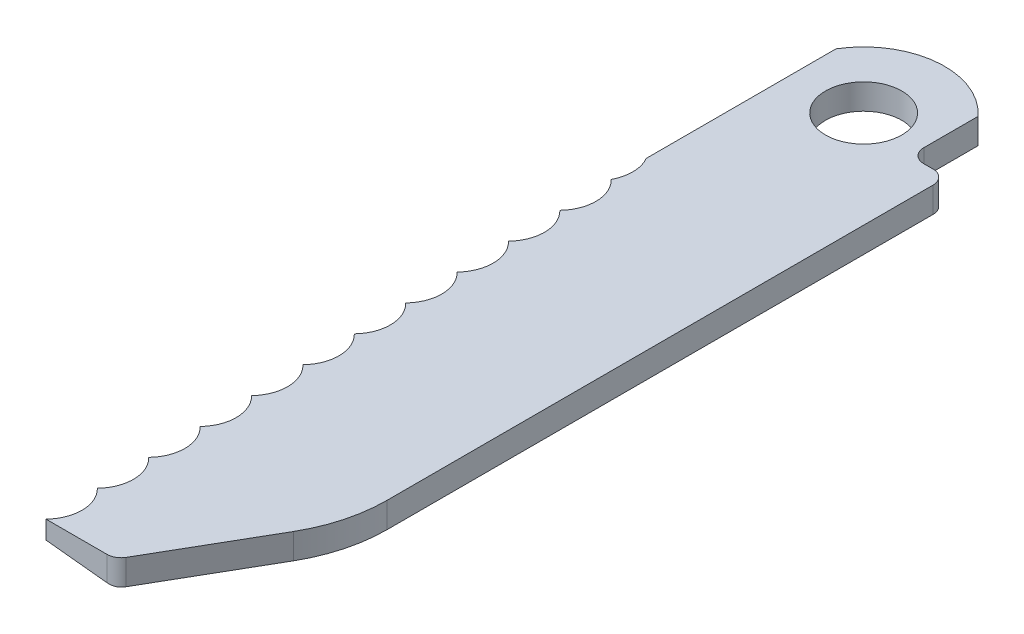
ISO-10303-21;
HEADER;
FILE_DESCRIPTION(('STEP AP214'),'2;1');
FILE_NAME('part.step','',(''),(''),'','','');
FILE_SCHEMA(('AUTOMOTIVE_DESIGN { 1 0 10303 214 1 1 1 1 }'));
ENDSEC;
DATA;
#1=APPLICATION_CONTEXT('core data for automotive mechanical design processes');
#2=APPLICATION_PROTOCOL_DEFINITION('international standard','automotive_design',2000,#1);
#3=PRODUCT_CONTEXT('',#1,'mechanical');
#4=PRODUCT('Part','Part','',(#3));
#5=PRODUCT_RELATED_PRODUCT_CATEGORY('part','',(#4));
#6=PRODUCT_DEFINITION_FORMATION('','',#4);
#7=PRODUCT_DEFINITION_CONTEXT('part definition',#1,'design');
#8=PRODUCT_DEFINITION('design','',#6,#7);
#9=PRODUCT_DEFINITION_SHAPE('','',#8);
#10=(LENGTH_UNIT() NAMED_UNIT(*) SI_UNIT(.MILLI.,.METRE.));
#11=(NAMED_UNIT(*) PLANE_ANGLE_UNIT() SI_UNIT($,.RADIAN.));
#12=(NAMED_UNIT(*) SI_UNIT($,.STERADIAN.) SOLID_ANGLE_UNIT());
#13=UNCERTAINTY_MEASURE_WITH_UNIT(LENGTH_MEASURE(1.E-05),#10,'distance_accuracy_value','');
#14=(GEOMETRIC_REPRESENTATION_CONTEXT(3) GLOBAL_UNCERTAINTY_ASSIGNED_CONTEXT((#13)) GLOBAL_UNIT_ASSIGNED_CONTEXT((#10,
#11,#12)) REPRESENTATION_CONTEXT('',''));
#15=CARTESIAN_POINT('',(0.,0.,0.));
#16=DIRECTION('',(0.,0.,1.));
#17=DIRECTION('',(1.,0.,0.));
#18=AXIS2_PLACEMENT_3D('',#15,#16,#17);
#19=CARTESIAN_POINT('',(54.9498322724168,1.397,-59.4302771299373));
#20=DIRECTION('',(0.,-1.,0.));
#21=DIRECTION('',(0.,0.,-1.));
#22=AXIS2_PLACEMENT_3D('',#19,#20,#21);
#23=PLANE('',#22);
#24=DIRECTION('',(1.,0.,0.));
#25=VECTOR('',#24,1.);
#26=CARTESIAN_POINT('',(51.8151166378925,1.397,-17.6669100205205));
#27=LINE('',#26,#25);
#28=CARTESIAN_POINT('',(51.8151166378925,1.397,-17.6669100205205));
#29=VERTEX_POINT('',#28);
#30=CARTESIAN_POINT('',(55.1734301787504,1.397,-17.6669100205205));
#31=VERTEX_POINT('',#30);
#32=EDGE_CURVE('E339',#29,#31,#27,.T.);
#33=ORIENTED_EDGE('',*,*,#32,.T.);
#34=CARTESIAN_POINT('',(55.1734301787504,1.397,-18.4289100205205));
#35=DIRECTION('',(0.,-1.,0.));
#36=DIRECTION('',(0.,0.,-1.));
#37=AXIS2_PLACEMENT_3D('',#34,#35,#36);
#38=CIRCLE('',#37,0.762);
#39=CARTESIAN_POINT('',(55.8333415364342,1.397,-18.0479100205205));
#40=VERTEX_POINT('',#39);
#41=EDGE_CURVE('E470',#31,#40,#38,.F.);
#42=ORIENTED_EDGE('',*,*,#41,.T.);
#43=DIRECTION('',(0.499999999999999,0.,-0.866025403784439));
#44=VECTOR('',#43,1.);
#45=CARTESIAN_POINT('',(59.1948867543767,1.397,-23.8702771299373));
#46=LINE('',#45,#44);
#47=CARTESIAN_POINT('',(59.1948867543767,1.397,-23.8702771299373));
#48=VERTEX_POINT('',#47);
#49=EDGE_CURVE('E343',#40,#48,#46,.T.);
#50=ORIENTED_EDGE('',*,*,#49,.T.);
#51=CARTESIAN_POINT('',(52.1558322724168,1.397,-27.9342771299373));
#52=DIRECTION('',(0.,1.,0.));
#53=DIRECTION('',(0.,0.,-1.));
#54=AXIS2_PLACEMENT_3D('',#51,#52,#53);
#55=CIRCLE('',#54,8.128);
#56=CARTESIAN_POINT('',(60.2838322724168,1.397,-27.9342771299373));
#57=VERTEX_POINT('',#56);
#58=EDGE_CURVE('E346',#48,#57,#55,.T.);
#59=ORIENTED_EDGE('',*,*,#58,.T.);
#60=DIRECTION('',(0.,0.,-1.));
#61=VECTOR('',#60,1.);
#62=CARTESIAN_POINT('',(60.2838322724168,1.397,-27.9342771299373));
#63=LINE('',#62,#61);
#64=CARTESIAN_POINT('',(60.2838322724168,1.397,-57.9062771299373));
#65=VERTEX_POINT('',#64);
#66=EDGE_CURVE('E349',#57,#65,#63,.T.);
#67=ORIENTED_EDGE('',*,*,#66,.T.);
#68=CARTESIAN_POINT('',(59.5218322724168,1.397,-57.9062771299373));
#69=DIRECTION('',(0.,-1.,0.));
#70=DIRECTION('',(0.,0.,-1.));
#71=AXIS2_PLACEMENT_3D('',#68,#69,#70);
#72=CIRCLE('',#71,0.762);
#73=CARTESIAN_POINT('',(59.5218322724168,1.397,-58.6682771299373));
#74=VERTEX_POINT('',#73);
#75=EDGE_CURVE('E467',#65,#74,#72,.F.);
#76=ORIENTED_EDGE('',*,*,#75,.T.);
#77=DIRECTION('',(-1.,0.,0.));
#78=VECTOR('',#77,1.);
#79=CARTESIAN_POINT('',(58.2518322724168,1.397,-58.6682771299373));
#80=LINE('',#79,#78);
#81=CARTESIAN_POINT('',(59.0138322724168,1.397,-58.6682771299373));
#82=VERTEX_POINT('',#81);
#83=EDGE_CURVE('E353',#74,#82,#80,.T.);
#84=ORIENTED_EDGE('',*,*,#83,.T.);
#85=CARTESIAN_POINT('',(59.0138322724168,1.397,-59.4302771299373));
#86=DIRECTION('',(0.,-1.,0.));
#87=DIRECTION('',(0.,0.,-1.));
#88=AXIS2_PLACEMENT_3D('',#85,#86,#87);
#89=CIRCLE('',#88,0.762);
#90=CARTESIAN_POINT('',(58.2518322724168,1.397,-59.4302771299373));
#91=VERTEX_POINT('',#90);
#92=EDGE_CURVE('E11',#82,#91,#89,.T.);
#93=ORIENTED_EDGE('',*,*,#92,.T.);
#94=DIRECTION('',(0.,0.,-1.));
#95=VECTOR('',#94,1.);
#96=CARTESIAN_POINT('',(58.2518322724168,1.397,-62.4076000241993));
#97=LINE('',#96,#95);
#98=CARTESIAN_POINT('',(58.2518322724168,1.397,-62.4076000241993));
#99=VERTEX_POINT('',#98);
#100=EDGE_CURVE('E356',#91,#99,#97,.T.);
#101=ORIENTED_EDGE('',*,*,#100,.T.);
#102=CARTESIAN_POINT('',(54.9498322724168,1.397,-59.4302771299373));
#103=DIRECTION('',(0.,1.,0.));
#104=DIRECTION('',(0.,0.,-1.));
#105=AXIS2_PLACEMENT_3D('',#102,#103,#104);
#106=CIRCLE('',#105,4.44608317698811);
#107=CARTESIAN_POINT('',(51.1398322724168,1.397,-61.7219044156661));
#108=VERTEX_POINT('',#107);
#109=EDGE_CURVE('E295',#99,#108,#106,.T.);
#110=ORIENTED_EDGE('',*,*,#109,.T.);
#111=DIRECTION('',(0.,0.,1.));
#112=VECTOR('',#111,1.);
#113=CARTESIAN_POINT('',(51.1398322724168,1.397,-61.7219044156661));
#114=LINE('',#113,#112);
#115=CARTESIAN_POINT('',(51.1398322724168,1.397,-51.3022771299373));
#116=VERTEX_POINT('',#115);
#117=EDGE_CURVE('E299',#108,#116,#114,.T.);
#118=ORIENTED_EDGE('',*,*,#117,.T.);
#119=CARTESIAN_POINT('',(49.3734833130726,1.397,-50.2862771299373));
#120=DIRECTION('',(0.,-1.,0.));
#121=DIRECTION('',(0.,0.,-1.));
#122=AXIS2_PLACEMENT_3D('',#119,#120,#121);
#123=CIRCLE('',#122,2.03770573100645);
#124=CARTESIAN_POINT('',(51.1791881674747,1.397,-49.3419918843865));
#125=VERTEX_POINT('',#124);
#126=EDGE_CURVE('E303',#116,#125,#123,.T.);
#127=ORIENTED_EDGE('',*,*,#126,.T.);
#128=CARTESIAN_POINT('',(49.7667004272661,1.397,-47.8732771299373));
#129=DIRECTION('',(0.,-1.,0.));
#130=DIRECTION('',(0.,0.,-1.));
#131=AXIS2_PLACEMENT_3D('',#128,#129,#130);
#132=CIRCLE('',#131,2.03770573100645);
#133=CARTESIAN_POINT('',(51.2369998466036,1.397,-46.4624389876714));
#134=VERTEX_POINT('',#133);
#135=EDGE_CURVE('E306',#125,#134,#132,.T.);
#136=ORIENTED_EDGE('',*,*,#135,.T.);
#137=CARTESIAN_POINT('',(49.824512106395,1.397,-44.9937242332222));
#138=DIRECTION('',(0.,-1.,0.));
#139=DIRECTION('',(0.,0.,-1.));
#140=AXIS2_PLACEMENT_3D('',#137,#138,#139);
#141=CIRCLE('',#140,2.03770573100645);
#142=CARTESIAN_POINT('',(51.2948115257325,1.397,-43.5828860909563));
#143=VERTEX_POINT('',#142);
#144=EDGE_CURVE('E309',#134,#143,#141,.T.);
#145=ORIENTED_EDGE('',*,*,#144,.T.);
#146=CARTESIAN_POINT('',(49.8823237855239,1.397,-42.1141713365071));
#147=DIRECTION('',(0.,-1.,0.));
#148=DIRECTION('',(0.,0.,1.));
#149=AXIS2_PLACEMENT_3D('',#146,#147,#148);
#150=CIRCLE('',#149,2.03770573100645);
#151=CARTESIAN_POINT('',(51.3526232048614,1.397,-40.7033331942412));
#152=VERTEX_POINT('',#151);
#153=EDGE_CURVE('E312',#143,#152,#150,.T.);
#154=ORIENTED_EDGE('',*,*,#153,.T.);
#155=CARTESIAN_POINT('',(49.9401354646528,1.397,-39.234618439792));
#156=DIRECTION('',(0.,-1.,0.));
#157=DIRECTION('',(0.,0.,-1.));
#158=AXIS2_PLACEMENT_3D('',#155,#156,#157);
#159=CIRCLE('',#158,2.03770573100645);
#160=CARTESIAN_POINT('',(51.4104348839903,1.397,-37.8237802975261));
#161=VERTEX_POINT('',#160);
#162=EDGE_CURVE('E315',#152,#161,#159,.T.);
#163=ORIENTED_EDGE('',*,*,#162,.T.);
#164=CARTESIAN_POINT('',(49.9979471437816,1.397,-36.3550655430769));
#165=DIRECTION('',(0.,-1.,0.));
#166=DIRECTION('',(0.,0.,-1.));
#167=AXIS2_PLACEMENT_3D('',#164,#165,#166);
#168=CIRCLE('',#167,2.03770573100645);
#169=CARTESIAN_POINT('',(51.4682465631192,1.397,-34.944227400811));
#170=VERTEX_POINT('',#169);
#171=EDGE_CURVE('E318',#161,#170,#168,.T.);
#172=ORIENTED_EDGE('',*,*,#171,.T.);
#173=CARTESIAN_POINT('',(50.0557588229105,1.397,-33.4755126463618));
#174=DIRECTION('',(0.,-1.,0.));
#175=DIRECTION('',(0.,0.,1.));
#176=AXIS2_PLACEMENT_3D('',#173,#174,#175);
#177=CIRCLE('',#176,2.03770573100644);
#178=CARTESIAN_POINT('',(51.5260582422481,1.397,-32.064674504096));
#179=VERTEX_POINT('',#178);
#180=EDGE_CURVE('E321',#170,#179,#177,.T.);
#181=ORIENTED_EDGE('',*,*,#180,.T.);
#182=CARTESIAN_POINT('',(50.1135705020394,1.397,-30.5959597496467));
#183=DIRECTION('',(0.,-1.,0.));
#184=DIRECTION('',(0.,0.,-1.));
#185=AXIS2_PLACEMENT_3D('',#182,#183,#184);
#186=CIRCLE('',#185,2.03770573100645);
#187=CARTESIAN_POINT('',(51.583869921377,1.397,-29.1851216073809));
#188=VERTEX_POINT('',#187);
#189=EDGE_CURVE('E324',#179,#188,#186,.T.);
#190=ORIENTED_EDGE('',*,*,#189,.T.);
#191=CARTESIAN_POINT('',(50.1713821811683,1.397,-27.7164068529317));
#192=DIRECTION('',(0.,-1.,0.));
#193=DIRECTION('',(0.,0.,1.));
#194=AXIS2_PLACEMENT_3D('',#191,#192,#193);
#195=CIRCLE('',#194,2.03770573100645);
#196=CARTESIAN_POINT('',(51.6416816005058,1.397,-26.3055687106658));
#197=VERTEX_POINT('',#196);
#198=EDGE_CURVE('E327',#188,#197,#195,.T.);
#199=ORIENTED_EDGE('',*,*,#198,.T.);
#200=CARTESIAN_POINT('',(50.2291938602972,1.397,-24.8368539562166));
#201=DIRECTION('',(0.,-1.,0.));
#202=DIRECTION('',(0.,0.,-1.));
#203=AXIS2_PLACEMENT_3D('',#200,#201,#202);
#204=CIRCLE('',#203,2.03770573100645);
#205=CARTESIAN_POINT('',(51.6994932796347,1.397,-23.4260158139507));
#206=VERTEX_POINT('',#205);
#207=EDGE_CURVE('E330',#197,#206,#204,.T.);
#208=ORIENTED_EDGE('',*,*,#207,.T.);
#209=CARTESIAN_POINT('',(50.2870055394261,1.397,-21.9573010595015));
#210=DIRECTION('',(0.,-1.,0.));
#211=DIRECTION('',(0.,0.,1.));
#212=AXIS2_PLACEMENT_3D('',#209,#210,#211);
#213=CIRCLE('',#212,2.03770573100645);
#214=CARTESIAN_POINT('',(51.7573049587636,1.397,-20.5464629172356));
#215=VERTEX_POINT('',#214);
#216=EDGE_CURVE('E333',#206,#215,#213,.T.);
#217=ORIENTED_EDGE('',*,*,#216,.T.);
#218=CARTESIAN_POINT('',(50.344817218555,1.397,-19.0777481627864));
#219=DIRECTION('',(0.,-1.,0.));
#220=DIRECTION('',(0.,0.,-1.));
#221=AXIS2_PLACEMENT_3D('',#218,#219,#220);
#222=CIRCLE('',#221,2.03770573100645);
#223=EDGE_CURVE('E336',#215,#29,#222,.T.);
#224=ORIENTED_EDGE('',*,*,#223,.T.);
#225=EDGE_LOOP('',(#33,#42,#50,#59,#67,#76,#84,#93,#101,#110,#118,#127,#136,#145,#154,#163,#172,
#181,#190,#199,#208,#217,#224));
#226=FACE_BOUND('',#225,.T.);
#227=CARTESIAN_POINT('',(54.9498322724168,1.397,-59.4302771299373));
#228=DIRECTION('',(0.,1.,0.));
#229=DIRECTION('',(0.,0.,1.));
#230=AXIS2_PLACEMENT_3D('',#227,#228,#229);
#231=CIRCLE('',#230,2.0955);
#232=CARTESIAN_POINT('',(54.9498322724168,1.397,-57.3347771299373));
#233=VERTEX_POINT('',#232);
#234=EDGE_CURVE('E287',#233,#233,#231,.T.);
#235=ORIENTED_EDGE('',*,*,#234,.F.);
#236=EDGE_LOOP('',(#235));
#237=FACE_BOUND('',#236,.T.);
#238=ADVANCED_FACE('F38',(#226,#237),#23,.F.);
#239=CARTESIAN_POINT('',(54.9498322724168,0.,-59.4302771299373));
#240=DIRECTION('',(0.,-1.,0.));
#241=DIRECTION('',(0.,0.,-1.));
#242=AXIS2_PLACEMENT_3D('',#239,#240,#241);
#243=PLANE('',#242);
#244=DIRECTION('',(0.499999999999999,0.,-0.866025403784439));
#245=VECTOR('',#244,1.);
#246=CARTESIAN_POINT('',(59.1948867543767,0.,-23.8702771299373));
#247=LINE('',#246,#245);
#248=CARTESIAN_POINT('',(55.8333415364342,0.,-18.0479100205205));
#249=VERTEX_POINT('',#248);
#250=CARTESIAN_POINT('',(59.1948867543767,0.,-23.8702771299373));
#251=VERTEX_POINT('',#250);
#252=EDGE_CURVE('E366',#249,#251,#247,.T.);
#253=ORIENTED_EDGE('',*,*,#252,.F.);
#254=CARTESIAN_POINT('',(55.1734301787504,0.,-18.4289100205205));
#255=DIRECTION('',(0.,-1.,0.));
#256=DIRECTION('',(0.,0.,-1.));
#257=AXIS2_PLACEMENT_3D('',#254,#255,#256);
#258=CIRCLE('',#257,0.762);
#259=CARTESIAN_POINT('',(55.6133710838729,0.,-17.8067396258536));
#260=VERTEX_POINT('',#259);
#261=EDGE_CURVE('E229',#249,#260,#258,.T.);
#262=ORIENTED_EDGE('',*,*,#261,.T.);
#263=DIRECTION('',(0.,0.,1.));
#264=VECTOR('',#263,1.);
#265=CARTESIAN_POINT('',(55.6133710838729,0.,-52.4509999999999));
#266=LINE('',#265,#264);
#267=CARTESIAN_POINT('',(55.6133710838729,0.,-52.4509999999999));
#268=VERTEX_POINT('',#267);
#269=EDGE_CURVE('E210',#268,#260,#266,.T.);
#270=ORIENTED_EDGE('',*,*,#269,.F.);
#271=DIRECTION('',(1.,0.,0.));
#272=VECTOR('',#271,1.);
#273=CARTESIAN_POINT('',(51.1398322724168,0.,-52.4509999999999));
#274=LINE('',#273,#272);
#275=CARTESIAN_POINT('',(51.1398322724168,0.,-52.4509999999999));
#276=VERTEX_POINT('',#275);
#277=EDGE_CURVE('E218',#276,#268,#274,.T.);
#278=ORIENTED_EDGE('',*,*,#277,.F.);
#279=DIRECTION('',(0.,0.,1.));
#280=VECTOR('',#279,1.);
#281=CARTESIAN_POINT('',(51.1398322724168,0.,-61.7219044156661));
#282=LINE('',#281,#280);
#283=CARTESIAN_POINT('',(51.1398322724168,0.,-61.7219044156661));
#284=VERTEX_POINT('',#283);
#285=EDGE_CURVE('E363',#284,#276,#282,.T.);
#286=ORIENTED_EDGE('',*,*,#285,.F.);
#287=CARTESIAN_POINT('',(54.9498322724168,0.,-59.4302771299373));
#288=DIRECTION('',(0.,1.,0.));
#289=DIRECTION('',(0.,0.,-1.));
#290=AXIS2_PLACEMENT_3D('',#287,#288,#289);
#291=CIRCLE('',#290,4.44608317698811);
#292=CARTESIAN_POINT('',(58.2518322724168,0.,-62.4076000241993));
#293=VERTEX_POINT('',#292);
#294=EDGE_CURVE('E291',#293,#284,#291,.T.);
#295=ORIENTED_EDGE('',*,*,#294,.F.);
#296=DIRECTION('',(0.,0.,-1.));
#297=VECTOR('',#296,1.);
#298=CARTESIAN_POINT('',(58.2518322724168,0.,-62.4076000241993));
#299=LINE('',#298,#297);
#300=CARTESIAN_POINT('',(58.2518322724168,0.,-59.4302771299373));
#301=VERTEX_POINT('',#300);
#302=EDGE_CURVE('E300',#301,#293,#299,.T.);
#303=ORIENTED_EDGE('',*,*,#302,.F.);
#304=CARTESIAN_POINT('',(59.0138322724168,0.,-59.4302771299373));
#305=DIRECTION('',(0.,-1.,0.));
#306=DIRECTION('',(0.,0.,-1.));
#307=AXIS2_PLACEMENT_3D('',#304,#305,#306);
#308=CIRCLE('',#307,0.762);
#309=CARTESIAN_POINT('',(59.0138322724168,0.,-58.6682771299373));
#310=VERTEX_POINT('',#309);
#311=EDGE_CURVE('E47',#301,#310,#308,.F.);
#312=ORIENTED_EDGE('',*,*,#311,.T.);
#313=DIRECTION('',(-1.,0.,0.));
#314=VECTOR('',#313,1.);
#315=CARTESIAN_POINT('',(58.2518322724168,0.,-58.6682771299373));
#316=LINE('',#315,#314);
#317=CARTESIAN_POINT('',(59.5218322724168,0.,-58.6682771299373));
#318=VERTEX_POINT('',#317);
#319=EDGE_CURVE('E376',#318,#310,#316,.T.);
#320=ORIENTED_EDGE('',*,*,#319,.F.);
#321=CARTESIAN_POINT('',(59.5218322724168,0.,-57.9062771299373));
#322=DIRECTION('',(0.,-1.,0.));
#323=DIRECTION('',(0.,0.,-1.));
#324=AXIS2_PLACEMENT_3D('',#321,#322,#323);
#325=CIRCLE('',#324,0.762);
#326=CARTESIAN_POINT('',(60.2838322724168,0.,-57.9062771299373));
#327=VERTEX_POINT('',#326);
#328=EDGE_CURVE('E456',#318,#327,#325,.T.);
#329=ORIENTED_EDGE('',*,*,#328,.T.);
#330=DIRECTION('',(0.,0.,-1.));
#331=VECTOR('',#330,1.);
#332=CARTESIAN_POINT('',(60.2838322724168,0.,-27.9342771299373));
#333=LINE('',#332,#331);
#334=CARTESIAN_POINT('',(60.2838322724168,0.,-27.9342771299373));
#335=VERTEX_POINT('',#334);
#336=EDGE_CURVE('E372',#335,#327,#333,.T.);
#337=ORIENTED_EDGE('',*,*,#336,.F.);
#338=CARTESIAN_POINT('',(52.1558322724168,0.,-27.9342771299373));
#339=DIRECTION('',(0.,1.,0.));
#340=DIRECTION('',(0.,0.,-1.));
#341=AXIS2_PLACEMENT_3D('',#338,#339,#340);
#342=CIRCLE('',#341,8.128);
#343=EDGE_CURVE('E369',#251,#335,#342,.T.);
#344=ORIENTED_EDGE('',*,*,#343,.F.);
#345=EDGE_LOOP('',(#253,#262,#270,#278,#286,#295,#303,#312,#320,#329,#337,#344));
#346=FACE_BOUND('',#345,.T.);
#347=CARTESIAN_POINT('',(54.9498322724168,0.,-59.4302771299373));
#348=DIRECTION('',(0.,1.,0.));
#349=DIRECTION('',(0.,0.,1.));
#350=AXIS2_PLACEMENT_3D('',#347,#348,#349);
#351=CIRCLE('',#350,2.0955);
#352=CARTESIAN_POINT('',(54.9498322724168,0.,-57.3347771299373));
#353=VERTEX_POINT('',#352);
#354=EDGE_CURVE('E286',#353,#353,#351,.T.);
#355=ORIENTED_EDGE('',*,*,#354,.T.);
#356=EDGE_LOOP('',(#355));
#357=FACE_BOUND('',#356,.T.);
#358=ADVANCED_FACE('F227',(#346,#357),#243,.T.);
#359=CARTESIAN_POINT('',(54.9498322724168,1.397,-59.4302771299373));
#360=DIRECTION('',(0.,-1.,0.));
#361=DIRECTION('',(0.,0.,-1.));
#362=AXIS2_PLACEMENT_3D('',#359,#360,#361);
#363=CYLINDRICAL_SURFACE('',#362,4.44608317698811);
#364=ORIENTED_EDGE('',*,*,#294,.T.);
#365=DIRECTION('',(0.,-1.,0.));
#366=VECTOR('',#365,1.);
#367=CARTESIAN_POINT('',(51.1398322724168,1.397,-61.7219044156661));
#368=LINE('',#367,#366);
#369=EDGE_CURVE('E444',#108,#284,#368,.T.);
#370=ORIENTED_EDGE('',*,*,#369,.F.);
#371=ORIENTED_EDGE('',*,*,#109,.F.);
#372=DIRECTION('',(0.,-1.,0.));
#373=VECTOR('',#372,1.);
#374=CARTESIAN_POINT('',(58.2518322724168,1.397,-62.4076000241993));
#375=LINE('',#374,#373);
#376=EDGE_CURVE('E359',#99,#293,#375,.T.);
#377=ORIENTED_EDGE('',*,*,#376,.T.);
#378=EDGE_LOOP('',(#364,#370,#371,#377));
#379=FACE_BOUND('',#378,.T.);
#380=ADVANCED_FACE('F502',(#379),#363,.T.);
#381=CARTESIAN_POINT('',(51.1398322724168,1.397,-61.7219044156661));
#382=DIRECTION('',(1.,0.,0.));
#383=DIRECTION('',(0.,0.,-1.));
#384=AXIS2_PLACEMENT_3D('',#381,#382,#383);
#385=PLANE('',#384);
#386=DIRECTION('',(0.,-1.,0.));
#387=VECTOR('',#386,1.);
#388=CARTESIAN_POINT('',(51.1398322724168,0.470187875709384,-52.4509999999999));
#389=LINE('',#388,#387);
#390=CARTESIAN_POINT('',(51.1398322724168,0.470187875709384,-52.4509999999999));
#391=VERTEX_POINT('',#390);
#392=EDGE_CURVE('E217',#391,#276,#389,.T.);
#393=ORIENTED_EDGE('',*,*,#392,.F.);
#394=DIRECTION('',(0.,0.,1.));
#395=VECTOR('',#394,1.);
#396=CARTESIAN_POINT('',(51.1398322724168,0.470187875709384,-52.4509999999999));
#397=LINE('',#396,#395);
#398=CARTESIAN_POINT('',(51.1398322724168,0.470187875709384,-51.3022771299373));
#399=VERTEX_POINT('',#398);
#400=EDGE_CURVE('E213',#391,#399,#397,.T.);
#401=ORIENTED_EDGE('',*,*,#400,.T.);
#402=DIRECTION('',(0.,-1.,0.));
#403=VECTOR('',#402,1.);
#404=CARTESIAN_POINT('',(51.1398322724168,1.397,-51.3022771299373));
#405=LINE('',#404,#403);
#406=EDGE_CURVE('E440',#116,#399,#405,.T.);
#407=ORIENTED_EDGE('',*,*,#406,.F.);
#408=ORIENTED_EDGE('',*,*,#117,.F.);
#409=ORIENTED_EDGE('',*,*,#369,.T.);
#410=ORIENTED_EDGE('',*,*,#285,.T.);
#411=EDGE_LOOP('',(#393,#401,#407,#408,#409,#410));
#412=FACE_BOUND('',#411,.T.);
#413=ADVANCED_FACE('F504',(#412),#385,.F.);
#414=CARTESIAN_POINT('',(49.3734833130726,1.397,-50.2862771299373));
#415=DIRECTION('',(0.,-1.,0.));
#416=DIRECTION('',(0.,0.,-1.));
#417=AXIS2_PLACEMENT_3D('',#414,#415,#416);
#418=CYLINDRICAL_SURFACE('',#417,2.03770573100645);
#419=ORIENTED_EDGE('',*,*,#406,.T.);
#420=CARTESIAN_POINT('',(49.3734833130726,0.655838632293573,-50.2862771299373));
#421=DIRECTION('',(0.104528463267646,0.994521895368274,0.));
#422=DIRECTION('',(0.994521895368274,-0.104528463267646,0.));
#423=AXIS2_PLACEMENT_3D('',#420,#421,#422);
#424=ELLIPSE('',#423,2.04892998384101,2.03770573100645);
#425=CARTESIAN_POINT('',(51.1791881674747,0.466051404456125,-49.3419918843865));
#426=VERTEX_POINT('',#425);
#427=EDGE_CURVE('E282',#399,#426,#424,.F.);
#428=ORIENTED_EDGE('',*,*,#427,.T.);
#429=DIRECTION('',(0.,-1.,0.));
#430=VECTOR('',#429,1.);
#431=CARTESIAN_POINT('',(51.1791881674747,1.397,-49.3419918843865));
#432=LINE('',#431,#430);
#433=EDGE_CURVE('E436',#125,#426,#432,.T.);
#434=ORIENTED_EDGE('',*,*,#433,.F.);
#435=ORIENTED_EDGE('',*,*,#126,.F.);
#436=EDGE_LOOP('',(#419,#428,#434,#435));
#437=FACE_BOUND('',#436,.T.);
#438=ADVANCED_FACE('F508',(#437),#418,.F.);
#439=CARTESIAN_POINT('',(49.7667004272661,1.397,-47.8732771299373));
#440=DIRECTION('',(0.,-1.,0.));
#441=DIRECTION('',(0.,0.,-1.));
#442=AXIS2_PLACEMENT_3D('',#439,#440,#441);
#443=CYLINDRICAL_SURFACE('',#442,2.03770573100645);
#444=ORIENTED_EDGE('',*,*,#433,.T.);
#445=CARTESIAN_POINT('',(49.7667004272661,0.614509848212888,-47.8732771299373));
#446=DIRECTION('',(0.104528463267646,0.994521895368274,0.));
#447=DIRECTION('',(0.994521895368274,-0.104528463267646,0.));
#448=AXIS2_PLACEMENT_3D('',#445,#446,#447);
#449=ELLIPSE('',#448,2.04892998384101,2.03770573100645);
#450=CARTESIAN_POINT('',(51.2369998466036,0.459975152131858,-46.4624389876714));
#451=VERTEX_POINT('',#450);
#452=EDGE_CURVE('E278',#426,#451,#449,.F.);
#453=ORIENTED_EDGE('',*,*,#452,.T.);
#454=DIRECTION('',(0.,-1.,0.));
#455=VECTOR('',#454,1.);
#456=CARTESIAN_POINT('',(51.2369998466036,1.397,-46.4624389876714));
#457=LINE('',#456,#455);
#458=EDGE_CURVE('E432',#134,#451,#457,.T.);
#459=ORIENTED_EDGE('',*,*,#458,.F.);
#460=ORIENTED_EDGE('',*,*,#135,.F.);
#461=EDGE_LOOP('',(#444,#453,#459,#460));
#462=FACE_BOUND('',#461,.T.);
#463=ADVANCED_FACE('F514',(#462),#443,.F.);
#464=CARTESIAN_POINT('',(49.824512106395,1.397,-44.9937242332222));
#465=DIRECTION('',(0.,-1.,0.));
#466=DIRECTION('',(0.,0.,-1.));
#467=AXIS2_PLACEMENT_3D('',#464,#465,#466);
#468=CYLINDRICAL_SURFACE('',#467,2.03770573100645);
#469=ORIENTED_EDGE('',*,*,#458,.T.);
#470=CARTESIAN_POINT('',(49.824512106395,0.608433595888622,-44.9937242332222));
#471=DIRECTION('',(0.104528463267646,0.994521895368274,0.));
#472=DIRECTION('',(0.994521895368274,-0.104528463267646,0.));
#473=AXIS2_PLACEMENT_3D('',#470,#471,#472);
#474=ELLIPSE('',#473,2.04892998384101,2.03770573100645);
#475=CARTESIAN_POINT('',(51.2948115257325,0.453898899807592,-43.5828860909563));
#476=VERTEX_POINT('',#475);
#477=EDGE_CURVE('E274',#451,#476,#474,.F.);
#478=ORIENTED_EDGE('',*,*,#477,.T.);
#479=DIRECTION('',(0.,-1.,0.));
#480=VECTOR('',#479,1.);
#481=CARTESIAN_POINT('',(51.2948115257325,1.397,-43.5828860909563));
#482=LINE('',#481,#480);
#483=EDGE_CURVE('E428',#143,#476,#482,.T.);
#484=ORIENTED_EDGE('',*,*,#483,.F.);
#485=ORIENTED_EDGE('',*,*,#144,.F.);
#486=EDGE_LOOP('',(#469,#478,#484,#485));
#487=FACE_BOUND('',#486,.T.);
#488=ADVANCED_FACE('F516',(#487),#468,.F.);
#489=CARTESIAN_POINT('',(49.8823237855239,1.397,-42.1141713365071));
#490=DIRECTION('',(0.,-1.,0.));
#491=DIRECTION('',(0.,0.,-1.));
#492=AXIS2_PLACEMENT_3D('',#489,#490,#491);
#493=CYLINDRICAL_SURFACE('',#492,2.03770573100645);
#494=ORIENTED_EDGE('',*,*,#483,.T.);
#495=CARTESIAN_POINT('',(49.8823237855239,0.602357343564355,-42.1141713365071));
#496=DIRECTION('',(0.104528463267646,0.994521895368274,0.));
#497=DIRECTION('',(0.994521895368274,-0.104528463267646,0.));
#498=AXIS2_PLACEMENT_3D('',#495,#496,#497);
#499=ELLIPSE('',#498,2.04892998384101,2.03770573100645);
#500=CARTESIAN_POINT('',(51.3526232048614,0.447822647483327,-40.7033331942412));
#501=VERTEX_POINT('',#500);
#502=EDGE_CURVE('E270',#476,#501,#499,.F.);
#503=ORIENTED_EDGE('',*,*,#502,.T.);
#504=DIRECTION('',(0.,-1.,0.));
#505=VECTOR('',#504,1.);
#506=CARTESIAN_POINT('',(51.3526232048614,1.397,-40.7033331942412));
#507=LINE('',#506,#505);
#508=EDGE_CURVE('E424',#152,#501,#507,.T.);
#509=ORIENTED_EDGE('',*,*,#508,.F.);
#510=ORIENTED_EDGE('',*,*,#153,.F.);
#511=EDGE_LOOP('',(#494,#503,#509,#510));
#512=FACE_BOUND('',#511,.T.);
#513=ADVANCED_FACE('F520',(#512),#493,.F.);
#514=CARTESIAN_POINT('',(49.9401354646528,1.397,-39.234618439792));
#515=DIRECTION('',(0.,-1.,0.));
#516=DIRECTION('',(0.,0.,-1.));
#517=AXIS2_PLACEMENT_3D('',#514,#515,#516);
#518=CYLINDRICAL_SURFACE('',#517,2.03770573100645);
#519=ORIENTED_EDGE('',*,*,#508,.T.);
#520=CARTESIAN_POINT('',(49.9401354646528,0.59628109124009,-39.234618439792));
#521=DIRECTION('',(0.104528463267646,0.994521895368274,0.));
#522=DIRECTION('',(0.994521895368274,-0.104528463267646,0.));
#523=AXIS2_PLACEMENT_3D('',#520,#521,#522);
#524=ELLIPSE('',#523,2.04892998384101,2.03770573100645);
#525=CARTESIAN_POINT('',(51.4104348839903,0.44174639515906,-37.8237802975261));
#526=VERTEX_POINT('',#525);
#527=EDGE_CURVE('E266',#501,#526,#524,.F.);
#528=ORIENTED_EDGE('',*,*,#527,.T.);
#529=DIRECTION('',(0.,-1.,0.));
#530=VECTOR('',#529,1.);
#531=CARTESIAN_POINT('',(51.4104348839903,1.397,-37.8237802975261));
#532=LINE('',#531,#530);
#533=EDGE_CURVE('E420',#161,#526,#532,.T.);
#534=ORIENTED_EDGE('',*,*,#533,.F.);
#535=ORIENTED_EDGE('',*,*,#162,.F.);
#536=EDGE_LOOP('',(#519,#528,#534,#535));
#537=FACE_BOUND('',#536,.T.);
#538=ADVANCED_FACE('F526',(#537),#518,.F.);
#539=CARTESIAN_POINT('',(49.9979471437816,1.397,-36.3550655430769));
#540=DIRECTION('',(0.,-1.,0.));
#541=DIRECTION('',(0.,0.,-1.));
#542=AXIS2_PLACEMENT_3D('',#539,#540,#541);
#543=CYLINDRICAL_SURFACE('',#542,2.03770573100645);
#544=ORIENTED_EDGE('',*,*,#533,.T.);
#545=CARTESIAN_POINT('',(49.9979471437816,0.590204838915824,-36.3550655430769));
#546=DIRECTION('',(0.104528463267646,0.994521895368274,0.));
#547=DIRECTION('',(0.994521895368274,-0.104528463267646,0.));
#548=AXIS2_PLACEMENT_3D('',#545,#546,#547);
#549=ELLIPSE('',#548,2.04892998384101,2.03770573100645);
#550=CARTESIAN_POINT('',(51.4682465631192,0.435670142834795,-34.944227400811));
#551=VERTEX_POINT('',#550);
#552=EDGE_CURVE('E262',#526,#551,#549,.F.);
#553=ORIENTED_EDGE('',*,*,#552,.T.);
#554=DIRECTION('',(0.,-1.,0.));
#555=VECTOR('',#554,1.);
#556=CARTESIAN_POINT('',(51.4682465631192,1.397,-34.944227400811));
#557=LINE('',#556,#555);
#558=EDGE_CURVE('E416',#170,#551,#557,.T.);
#559=ORIENTED_EDGE('',*,*,#558,.F.);
#560=ORIENTED_EDGE('',*,*,#171,.F.);
#561=EDGE_LOOP('',(#544,#553,#559,#560));
#562=FACE_BOUND('',#561,.T.);
#563=ADVANCED_FACE('F528',(#562),#543,.F.);
#564=CARTESIAN_POINT('',(50.0557588229105,1.397,-33.4755126463618));
#565=DIRECTION('',(0.,-1.,0.));
#566=DIRECTION('',(0.,0.,-1.));
#567=AXIS2_PLACEMENT_3D('',#564,#565,#566);
#568=CYLINDRICAL_SURFACE('',#567,2.03770573100644);
#569=ORIENTED_EDGE('',*,*,#558,.T.);
#570=CARTESIAN_POINT('',(50.0557588229105,0.584128586591558,-33.4755126463618));
#571=DIRECTION('',(0.104528463267646,0.994521895368274,0.));
#572=DIRECTION('',(0.994521895368274,-0.104528463267646,0.));
#573=AXIS2_PLACEMENT_3D('',#570,#571,#572);
#574=ELLIPSE('',#573,2.048929983841,2.03770573100644);
#575=CARTESIAN_POINT('',(51.5260582422481,0.429593890510529,-32.064674504096));
#576=VERTEX_POINT('',#575);
#577=EDGE_CURVE('E258',#551,#576,#574,.F.);
#578=ORIENTED_EDGE('',*,*,#577,.T.);
#579=DIRECTION('',(0.,-1.,0.));
#580=VECTOR('',#579,1.);
#581=CARTESIAN_POINT('',(51.5260582422481,1.397,-32.064674504096));
#582=LINE('',#581,#580);
#583=EDGE_CURVE('E412',#179,#576,#582,.T.);
#584=ORIENTED_EDGE('',*,*,#583,.F.);
#585=ORIENTED_EDGE('',*,*,#180,.F.);
#586=EDGE_LOOP('',(#569,#578,#584,#585));
#587=FACE_BOUND('',#586,.T.);
#588=ADVANCED_FACE('F532',(#587),#568,.F.);
#589=CARTESIAN_POINT('',(50.1135705020394,1.397,-30.5959597496467));
#590=DIRECTION('',(0.,-1.,0.));
#591=DIRECTION('',(0.,0.,-1.));
#592=AXIS2_PLACEMENT_3D('',#589,#590,#591);
#593=CYLINDRICAL_SURFACE('',#592,2.03770573100645);
#594=ORIENTED_EDGE('',*,*,#583,.T.);
#595=CARTESIAN_POINT('',(50.1135705020394,0.578052334267291,-30.5959597496467));
#596=DIRECTION('',(0.104528463267646,0.994521895368274,0.));
#597=DIRECTION('',(0.994521895368274,-0.104528463267646,0.));
#598=AXIS2_PLACEMENT_3D('',#595,#596,#597);
#599=ELLIPSE('',#598,2.04892998384101,2.03770573100645);
#600=CARTESIAN_POINT('',(51.583869921377,0.423517638186263,-29.1851216073809));
#601=VERTEX_POINT('',#600);
#602=EDGE_CURVE('E254',#576,#601,#599,.F.);
#603=ORIENTED_EDGE('',*,*,#602,.T.);
#604=DIRECTION('',(0.,-1.,0.));
#605=VECTOR('',#604,1.);
#606=CARTESIAN_POINT('',(51.583869921377,1.397,-29.1851216073809));
#607=LINE('',#606,#605);
#608=EDGE_CURVE('E408',#188,#601,#607,.T.);
#609=ORIENTED_EDGE('',*,*,#608,.F.);
#610=ORIENTED_EDGE('',*,*,#189,.F.);
#611=EDGE_LOOP('',(#594,#603,#609,#610));
#612=FACE_BOUND('',#611,.T.);
#613=ADVANCED_FACE('F538',(#612),#593,.F.);
#614=CARTESIAN_POINT('',(50.1713821811683,1.397,-27.7164068529317));
#615=DIRECTION('',(0.,-1.,0.));
#616=DIRECTION('',(0.,0.,-1.));
#617=AXIS2_PLACEMENT_3D('',#614,#615,#616);
#618=CYLINDRICAL_SURFACE('',#617,2.03770573100645);
#619=ORIENTED_EDGE('',*,*,#608,.T.);
#620=CARTESIAN_POINT('',(50.1713821811683,0.571976081943026,-27.7164068529317));
#621=DIRECTION('',(0.104528463267646,0.994521895368274,0.));
#622=DIRECTION('',(0.994521895368274,-0.104528463267646,0.));
#623=AXIS2_PLACEMENT_3D('',#620,#621,#622);
#624=ELLIPSE('',#623,2.04892998384101,2.03770573100645);
#625=CARTESIAN_POINT('',(51.6416816005058,0.417441385861996,-26.3055687106658));
#626=VERTEX_POINT('',#625);
#627=EDGE_CURVE('E250',#601,#626,#624,.F.);
#628=ORIENTED_EDGE('',*,*,#627,.T.);
#629=DIRECTION('',(0.,-1.,0.));
#630=VECTOR('',#629,1.);
#631=CARTESIAN_POINT('',(51.6416816005058,1.397,-26.3055687106658));
#632=LINE('',#631,#630);
#633=EDGE_CURVE('E404',#197,#626,#632,.T.);
#634=ORIENTED_EDGE('',*,*,#633,.F.);
#635=ORIENTED_EDGE('',*,*,#198,.F.);
#636=EDGE_LOOP('',(#619,#628,#634,#635));
#637=FACE_BOUND('',#636,.T.);
#638=ADVANCED_FACE('F540',(#637),#618,.F.);
#639=CARTESIAN_POINT('',(50.2291938602972,1.397,-24.8368539562166));
#640=DIRECTION('',(0.,-1.,0.));
#641=DIRECTION('',(0.,0.,-1.));
#642=AXIS2_PLACEMENT_3D('',#639,#640,#641);
#643=CYLINDRICAL_SURFACE('',#642,2.03770573100645);
#644=ORIENTED_EDGE('',*,*,#633,.T.);
#645=CARTESIAN_POINT('',(50.2291938602972,0.56589982961876,-24.8368539562166));
#646=DIRECTION('',(0.104528463267646,0.994521895368274,0.));
#647=DIRECTION('',(0.994521895368274,-0.104528463267646,0.));
#648=AXIS2_PLACEMENT_3D('',#645,#646,#647);
#649=ELLIPSE('',#648,2.04892998384102,2.03770573100645);
#650=CARTESIAN_POINT('',(51.6994932796347,0.411365133537731,-23.4260158139507));
#651=VERTEX_POINT('',#650);
#652=EDGE_CURVE('E246',#626,#651,#649,.F.);
#653=ORIENTED_EDGE('',*,*,#652,.T.);
#654=DIRECTION('',(0.,-1.,0.));
#655=VECTOR('',#654,1.);
#656=CARTESIAN_POINT('',(51.6994932796347,1.397,-23.4260158139507));
#657=LINE('',#656,#655);
#658=EDGE_CURVE('E400',#206,#651,#657,.T.);
#659=ORIENTED_EDGE('',*,*,#658,.F.);
#660=ORIENTED_EDGE('',*,*,#207,.F.);
#661=EDGE_LOOP('',(#644,#653,#659,#660));
#662=FACE_BOUND('',#661,.T.);
#663=ADVANCED_FACE('F544',(#662),#643,.F.);
#664=CARTESIAN_POINT('',(50.2870055394261,1.397,-21.9573010595015));
#665=DIRECTION('',(0.,-1.,0.));
#666=DIRECTION('',(0.,0.,-1.));
#667=AXIS2_PLACEMENT_3D('',#664,#665,#666);
#668=CYLINDRICAL_SURFACE('',#667,2.03770573100645);
#669=ORIENTED_EDGE('',*,*,#658,.T.);
#670=CARTESIAN_POINT('',(50.2870055394261,0.559823577294494,-21.9573010595015));
#671=DIRECTION('',(0.104528463267646,0.994521895368274,0.));
#672=DIRECTION('',(0.994521895368274,-0.104528463267646,0.));
#673=AXIS2_PLACEMENT_3D('',#670,#671,#672);
#674=ELLIPSE('',#673,2.04892998384101,2.03770573100645);
#675=CARTESIAN_POINT('',(51.7573049587636,0.405288881213465,-20.5464629172356));
#676=VERTEX_POINT('',#675);
#677=EDGE_CURVE('E242',#651,#676,#674,.F.);
#678=ORIENTED_EDGE('',*,*,#677,.T.);
#679=DIRECTION('',(0.,-1.,0.));
#680=VECTOR('',#679,1.);
#681=CARTESIAN_POINT('',(51.7573049587636,1.397,-20.5464629172356));
#682=LINE('',#681,#680);
#683=EDGE_CURVE('E396',#215,#676,#682,.T.);
#684=ORIENTED_EDGE('',*,*,#683,.F.);
#685=ORIENTED_EDGE('',*,*,#216,.F.);
#686=EDGE_LOOP('',(#669,#678,#684,#685));
#687=FACE_BOUND('',#686,.T.);
#688=ADVANCED_FACE('F550',(#687),#668,.F.);
#689=CARTESIAN_POINT('',(50.344817218555,1.397,-19.0777481627864));
#690=DIRECTION('',(0.,-1.,0.));
#691=DIRECTION('',(0.,0.,-1.));
#692=AXIS2_PLACEMENT_3D('',#689,#690,#691);
#693=CYLINDRICAL_SURFACE('',#692,2.03770573100645);
#694=ORIENTED_EDGE('',*,*,#683,.T.);
#695=CARTESIAN_POINT('',(50.344817218555,0.553747324970227,-19.0777481627864));
#696=DIRECTION('',(0.104528463267646,0.994521895368274,0.));
#697=DIRECTION('',(0.994521895368274,-0.104528463267646,0.));
#698=AXIS2_PLACEMENT_3D('',#695,#696,#697);
#699=ELLIPSE('',#698,2.04892998384101,2.03770573100645);
#700=CARTESIAN_POINT('',(51.8151166378925,0.399212628889199,-17.6669100205205));
#701=VERTEX_POINT('',#700);
#702=EDGE_CURVE('E235',#676,#701,#699,.F.);
#703=ORIENTED_EDGE('',*,*,#702,.T.);
#704=DIRECTION('',(0.,-1.,0.));
#705=VECTOR('',#704,1.);
#706=CARTESIAN_POINT('',(51.8151166378925,1.397,-17.6669100205205));
#707=LINE('',#706,#705);
#708=EDGE_CURVE('E392',#29,#701,#707,.T.);
#709=ORIENTED_EDGE('',*,*,#708,.F.);
#710=ORIENTED_EDGE('',*,*,#223,.F.);
#711=EDGE_LOOP('',(#694,#703,#709,#710));
#712=FACE_BOUND('',#711,.T.);
#713=ADVANCED_FACE('F552',(#712),#693,.F.);
#714=CARTESIAN_POINT('',(51.8151166378925,1.397,-17.6669100205205));
#715=DIRECTION('',(0.,0.,-1.));
#716=DIRECTION('',(-1.,0.,0.));
#717=AXIS2_PLACEMENT_3D('',#714,#715,#716);
#718=PLANE('',#717);
#719=DIRECTION('',(0.994521895368274,-0.104528463267646,0.));
#720=VECTOR('',#719,1.);
#721=CARTESIAN_POINT('',(51.7113908081904,0.410114652897337,-17.6669100205205));
#722=LINE('',#721,#720);
#723=CARTESIAN_POINT('',(55.1734301787504,0.0462396523949867,-17.6669100205205));
#724=VERTEX_POINT('',#723);
#725=EDGE_CURVE('E448',#701,#724,#722,.T.);
#726=ORIENTED_EDGE('',*,*,#725,.T.);
#727=DIRECTION('',(0.,-1.,0.));
#728=VECTOR('',#727,1.);
#729=CARTESIAN_POINT('',(55.1734301787504,1.397,-17.6669100205205));
#730=LINE('',#729,#728);
#731=EDGE_CURVE('E464',#724,#31,#730,.F.);
#732=ORIENTED_EDGE('',*,*,#731,.T.);
#733=ORIENTED_EDGE('',*,*,#32,.F.);
#734=ORIENTED_EDGE('',*,*,#708,.T.);
#735=EDGE_LOOP('',(#726,#732,#733,#734));
#736=FACE_BOUND('',#735,.T.);
#737=ADVANCED_FACE('F555',(#736),#718,.F.);
#738=CARTESIAN_POINT('',(59.1948867543767,1.397,-23.8702771299373));
#739=DIRECTION('',(-0.866025403784439,0.,-0.499999999999999));
#740=DIRECTION('',(-0.499999999999999,0.,0.866025403784439));
#741=AXIS2_PLACEMENT_3D('',#738,#739,#740);
#742=PLANE('',#741);
#743=ORIENTED_EDGE('',*,*,#49,.F.);
#744=DIRECTION('',(0.,-1.,0.));
#745=VECTOR('',#744,1.);
#746=CARTESIAN_POINT('',(55.8333415364342,1.397,-18.0479100205205));
#747=LINE('',#746,#745);
#748=EDGE_CURVE('E452',#40,#249,#747,.T.);
#749=ORIENTED_EDGE('',*,*,#748,.T.);
#750=ORIENTED_EDGE('',*,*,#252,.T.);
#751=DIRECTION('',(0.,-1.,0.));
#752=VECTOR('',#751,1.);
#753=CARTESIAN_POINT('',(59.1948867543767,1.397,-23.8702771299373));
#754=LINE('',#753,#752);
#755=EDGE_CURVE('E388',#48,#251,#754,.T.);
#756=ORIENTED_EDGE('',*,*,#755,.F.);
#757=EDGE_LOOP('',(#743,#749,#750,#756));
#758=FACE_BOUND('',#757,.T.);
#759=ADVANCED_FACE('F563',(#758),#742,.F.);
#760=CARTESIAN_POINT('',(52.1558322724168,1.397,-27.9342771299373));
#761=DIRECTION('',(0.,-1.,0.));
#762=DIRECTION('',(0.,0.,-1.));
#763=AXIS2_PLACEMENT_3D('',#760,#761,#762);
#764=CYLINDRICAL_SURFACE('',#763,8.128);
#765=ORIENTED_EDGE('',*,*,#343,.T.);
#766=DIRECTION('',(0.,-1.,0.));
#767=VECTOR('',#766,1.);
#768=CARTESIAN_POINT('',(60.2838322724168,1.397,-27.9342771299373));
#769=LINE('',#768,#767);
#770=EDGE_CURVE('E384',#57,#335,#769,.T.);
#771=ORIENTED_EDGE('',*,*,#770,.F.);
#772=ORIENTED_EDGE('',*,*,#58,.F.);
#773=ORIENTED_EDGE('',*,*,#755,.T.);
#774=EDGE_LOOP('',(#765,#771,#772,#773));
#775=FACE_BOUND('',#774,.T.);
#776=ADVANCED_FACE('F569',(#775),#764,.T.);
#777=CARTESIAN_POINT('',(60.2838322724168,1.397,-27.9342771299373));
#778=DIRECTION('',(-1.,0.,0.));
#779=DIRECTION('',(0.,0.,1.));
#780=AXIS2_PLACEMENT_3D('',#777,#778,#779);
#781=PLANE('',#780);
#782=ORIENTED_EDGE('',*,*,#336,.T.);
#783=DIRECTION('',(0.,-1.,0.));
#784=VECTOR('',#783,1.);
#785=CARTESIAN_POINT('',(60.2838322724168,1.397,-57.9062771299373));
#786=LINE('',#785,#784);
#787=EDGE_CURVE('E479',#327,#65,#786,.F.);
#788=ORIENTED_EDGE('',*,*,#787,.T.);
#789=ORIENTED_EDGE('',*,*,#66,.F.);
#790=ORIENTED_EDGE('',*,*,#770,.T.);
#791=EDGE_LOOP('',(#782,#788,#789,#790));
#792=FACE_BOUND('',#791,.T.);
#793=ADVANCED_FACE('F573',(#792),#781,.F.);
#794=CARTESIAN_POINT('',(58.2518322724168,1.397,-58.6682771299373));
#795=DIRECTION('',(0.,0.,1.));
#796=DIRECTION('',(1.,0.,0.));
#797=AXIS2_PLACEMENT_3D('',#794,#795,#796);
#798=PLANE('',#797);
#799=ORIENTED_EDGE('',*,*,#83,.F.);
#800=DIRECTION('',(0.,-1.,0.));
#801=VECTOR('',#800,1.);
#802=CARTESIAN_POINT('',(59.5218322724168,1.397,-58.6682771299373));
#803=LINE('',#802,#801);
#804=EDGE_CURVE('E475',#74,#318,#803,.T.);
#805=ORIENTED_EDGE('',*,*,#804,.T.);
#806=ORIENTED_EDGE('',*,*,#319,.T.);
#807=DIRECTION('',(0.,-1.,0.));
#808=VECTOR('',#807,1.);
#809=CARTESIAN_POINT('',(59.0138322724168,1.397,-58.6682771299373));
#810=LINE('',#809,#808);
#811=EDGE_CURVE('E60',#310,#82,#810,.F.);
#812=ORIENTED_EDGE('',*,*,#811,.T.);
#813=EDGE_LOOP('',(#799,#805,#806,#812));
#814=FACE_BOUND('',#813,.T.);
#815=ADVANCED_FACE('F492',(#814),#798,.F.);
#816=CARTESIAN_POINT('',(58.2518322724168,1.397,-62.4076000241993));
#817=DIRECTION('',(-1.,0.,0.));
#818=DIRECTION('',(0.,0.,1.));
#819=AXIS2_PLACEMENT_3D('',#816,#817,#818);
#820=PLANE('',#819);
#821=ORIENTED_EDGE('',*,*,#100,.F.);
#822=DIRECTION('',(0.,-1.,0.));
#823=VECTOR('',#822,1.);
#824=CARTESIAN_POINT('',(58.2518322724168,0.,-59.4302771299373));
#825=LINE('',#824,#823);
#826=EDGE_CURVE('E482',#91,#301,#825,.T.);
#827=ORIENTED_EDGE('',*,*,#826,.T.);
#828=ORIENTED_EDGE('',*,*,#302,.T.);
#829=ORIENTED_EDGE('',*,*,#376,.F.);
#830=EDGE_LOOP('',(#821,#827,#828,#829));
#831=FACE_BOUND('',#830,.T.);
#832=ADVANCED_FACE('F495',(#831),#820,.F.);
#833=CARTESIAN_POINT('',(54.9498322724168,1.397,-59.4302771299373));
#834=DIRECTION('',(0.,-1.,0.));
#835=DIRECTION('',(0.,0.,-1.));
#836=AXIS2_PLACEMENT_3D('',#833,#834,#835);
#837=CYLINDRICAL_SURFACE('',#836,2.0955);
#838=ORIENTED_EDGE('',*,*,#234,.T.);
#839=EDGE_LOOP('',(#838));
#840=FACE_BOUND('',#839,.T.);
#841=ORIENTED_EDGE('',*,*,#354,.F.);
#842=EDGE_LOOP('',(#841));
#843=FACE_BOUND('',#842,.T.);
#844=ADVANCED_FACE('F591',(#840,#843),#837,.F.);
#845=CARTESIAN_POINT('',(55.6133710838729,0.,-52.4509999999999));
#846=DIRECTION('',(0.104528463267646,0.994521895368274,0.));
#847=DIRECTION('',(-0.994521895368274,0.104528463267646,0.));
#848=AXIS2_PLACEMENT_3D('',#845,#846,#847);
#849=PLANE('',#848);
#850=ORIENTED_EDGE('',*,*,#269,.T.);
#851=CARTESIAN_POINT('',(55.1734301787504,0.0462396523949866,-18.4289100205205));
#852=DIRECTION('',(0.104528463267646,0.994521895368274,0.));
#853=DIRECTION('',(0.994521895368274,-0.104528463267646,0.));
#854=AXIS2_PLACEMENT_3D('',#851,#852,#853);
#855=ELLIPSE('',#854,0.766197309027399,0.762);
#856=EDGE_CURVE('E461',#260,#724,#855,.F.);
#857=ORIENTED_EDGE('',*,*,#856,.T.);
#858=ORIENTED_EDGE('',*,*,#725,.F.);
#859=ORIENTED_EDGE('',*,*,#702,.F.);
#860=ORIENTED_EDGE('',*,*,#677,.F.);
#861=ORIENTED_EDGE('',*,*,#652,.F.);
#862=ORIENTED_EDGE('',*,*,#627,.F.);
#863=ORIENTED_EDGE('',*,*,#602,.F.);
#864=ORIENTED_EDGE('',*,*,#577,.F.);
#865=ORIENTED_EDGE('',*,*,#552,.F.);
#866=ORIENTED_EDGE('',*,*,#527,.F.);
#867=ORIENTED_EDGE('',*,*,#502,.F.);
#868=ORIENTED_EDGE('',*,*,#477,.F.);
#869=ORIENTED_EDGE('',*,*,#452,.F.);
#870=ORIENTED_EDGE('',*,*,#427,.F.);
#871=ORIENTED_EDGE('',*,*,#400,.F.);
#872=DIRECTION('',(-0.994521895368274,0.104528463267646,0.));
#873=VECTOR('',#872,1.);
#874=CARTESIAN_POINT('',(55.6133710838729,0.,-52.4509999999999));
#875=LINE('',#874,#873);
#876=EDGE_CURVE('E206',#268,#391,#875,.T.);
#877=ORIENTED_EDGE('',*,*,#876,.F.);
#878=EDGE_LOOP('',(#850,#857,#858,#859,#860,#861,#862,#863,#864,#865,#866,#867,#868,#869,#870,
#871,#877));
#879=FACE_BOUND('',#878,.T.);
#880=ADVANCED_FACE('F208',(#879),#849,.F.);
#881=CARTESIAN_POINT('',(0.,0.,-52.4509999999999));
#882=DIRECTION('',(0.,0.,-1.));
#883=DIRECTION('',(-1.,0.,0.));
#884=AXIS2_PLACEMENT_3D('',#881,#882,#883);
#885=PLANE('',#884);
#886=ORIENTED_EDGE('',*,*,#277,.T.);
#887=ORIENTED_EDGE('',*,*,#876,.T.);
#888=ORIENTED_EDGE('',*,*,#392,.T.);
#889=EDGE_LOOP('',(#886,#887,#888));
#890=FACE_BOUND('',#889,.T.);
#891=ADVANCED_FACE('F221',(#890),#885,.F.);
#892=CARTESIAN_POINT('',(55.1734301787504,1.397,-18.4289100205205));
#893=DIRECTION('',(0.,-1.,0.));
#894=DIRECTION('',(0.,0.,-1.));
#895=AXIS2_PLACEMENT_3D('',#892,#893,#894);
#896=CYLINDRICAL_SURFACE('',#895,0.762);
#897=ORIENTED_EDGE('',*,*,#41,.F.);
#898=ORIENTED_EDGE('',*,*,#731,.F.);
#899=ORIENTED_EDGE('',*,*,#856,.F.);
#900=ORIENTED_EDGE('',*,*,#261,.F.);
#901=ORIENTED_EDGE('',*,*,#748,.F.);
#902=EDGE_LOOP('',(#897,#898,#899,#900,#901));
#903=FACE_BOUND('',#902,.T.);
#904=ADVANCED_FACE('F561',(#903),#896,.T.);
#905=CARTESIAN_POINT('',(59.5218322724168,1.397,-57.9062771299373));
#906=DIRECTION('',(0.,-1.,0.));
#907=DIRECTION('',(0.,0.,-1.));
#908=AXIS2_PLACEMENT_3D('',#905,#906,#907);
#909=CYLINDRICAL_SURFACE('',#908,0.762);
#910=ORIENTED_EDGE('',*,*,#75,.F.);
#911=ORIENTED_EDGE('',*,*,#787,.F.);
#912=ORIENTED_EDGE('',*,*,#328,.F.);
#913=ORIENTED_EDGE('',*,*,#804,.F.);
#914=EDGE_LOOP('',(#910,#911,#912,#913));
#915=FACE_BOUND('',#914,.T.);
#916=ADVANCED_FACE('F577',(#915),#909,.T.);
#917=CARTESIAN_POINT('',(59.0138322724168,1.397,-59.4302771299373));
#918=DIRECTION('',(0.,1.,0.));
#919=DIRECTION('',(0.,0.,1.));
#920=AXIS2_PLACEMENT_3D('',#917,#918,#919);
#921=CYLINDRICAL_SURFACE('',#920,0.762);
#922=ORIENTED_EDGE('',*,*,#92,.F.);
#923=ORIENTED_EDGE('',*,*,#811,.F.);
#924=ORIENTED_EDGE('',*,*,#311,.F.);
#925=ORIENTED_EDGE('',*,*,#826,.F.);
#926=EDGE_LOOP('',(#922,#923,#924,#925));
#927=FACE_BOUND('',#926,.T.);
#928=ADVANCED_FACE('F40',(#927),#921,.F.);
#929=CLOSED_SHELL('',(#238,#358,#380,#413,#438,#463,#488,#513,#538,#563,#588,#613,#638,#663,
#688,#713,#737,#759,#776,#793,#815,#832,#844,#880,#891,#904,#916,#928));
#930=MANIFOLD_SOLID_BREP('B2',#929);
#931=ADVANCED_BREP_SHAPE_REPRESENTATION('',(#18,#930),#14);
#932=SHAPE_DEFINITION_REPRESENTATION(#9,#931);
ENDSEC;
END-ISO-10303-21;
